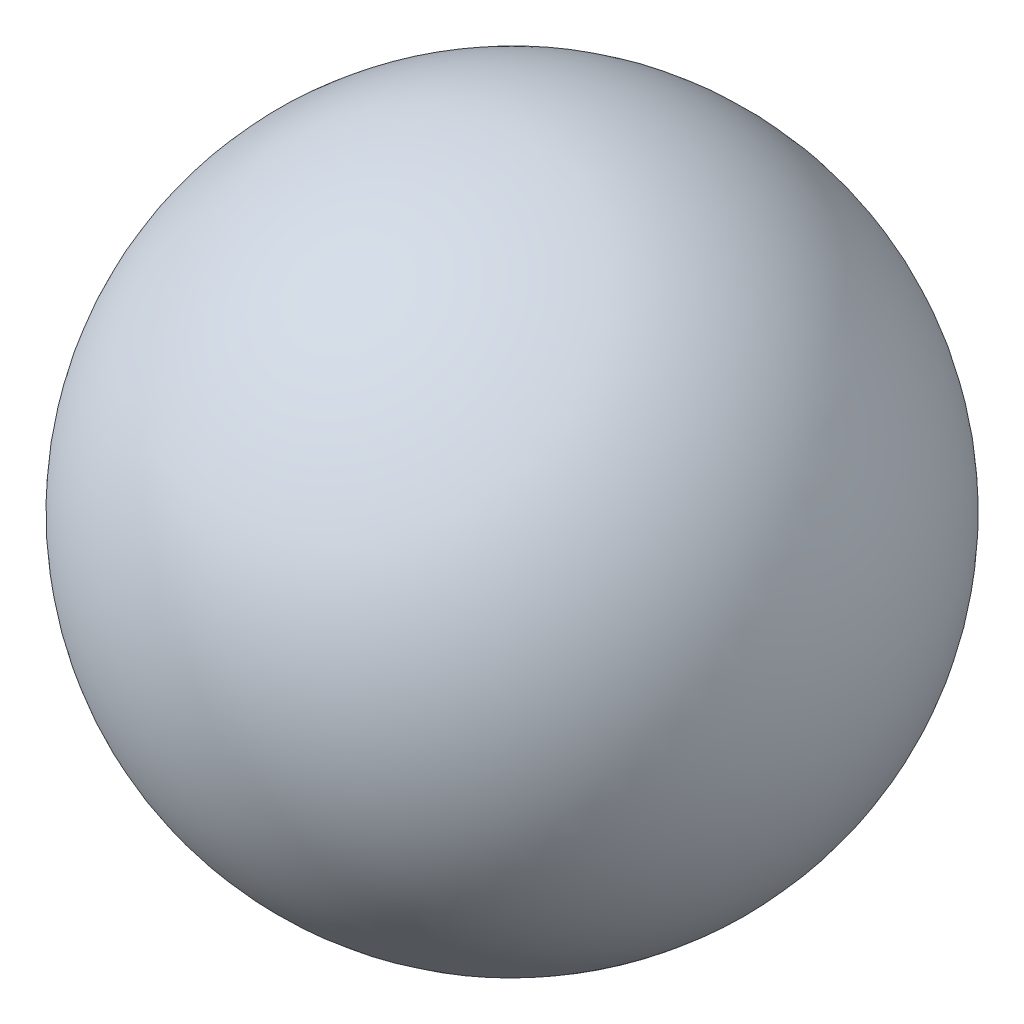
ISO-10303-21;
HEADER;
FILE_DESCRIPTION(('STEP AP214'),'2;1');
FILE_NAME('part.step','',(''),(''),'','','');
FILE_SCHEMA(('AUTOMOTIVE_DESIGN { 1 0 10303 214 1 1 1 1 }'));
ENDSEC;
DATA;
#1=APPLICATION_CONTEXT('core data for automotive mechanical design processes');
#2=APPLICATION_PROTOCOL_DEFINITION('international standard','automotive_design',2000,#1);
#3=PRODUCT_CONTEXT('',#1,'mechanical');
#4=PRODUCT('Part','Part','',(#3));
#5=PRODUCT_RELATED_PRODUCT_CATEGORY('part','',(#4));
#6=PRODUCT_DEFINITION_FORMATION('','',#4);
#7=PRODUCT_DEFINITION_CONTEXT('part definition',#1,'design');
#8=PRODUCT_DEFINITION('design','',#6,#7);
#9=PRODUCT_DEFINITION_SHAPE('','',#8);
#10=(LENGTH_UNIT() NAMED_UNIT(*) SI_UNIT(.MILLI.,.METRE.));
#11=(NAMED_UNIT(*) PLANE_ANGLE_UNIT() SI_UNIT($,.RADIAN.));
#12=(NAMED_UNIT(*) SI_UNIT($,.STERADIAN.) SOLID_ANGLE_UNIT());
#13=UNCERTAINTY_MEASURE_WITH_UNIT(LENGTH_MEASURE(1.E-05),#10,'distance_accuracy_value','');
#14=(GEOMETRIC_REPRESENTATION_CONTEXT(3) GLOBAL_UNCERTAINTY_ASSIGNED_CONTEXT((#13)) GLOBAL_UNIT_ASSIGNED_CONTEXT((#10,
#11,#12)) REPRESENTATION_CONTEXT('',''));
#15=CARTESIAN_POINT('',(0.,0.,0.));
#16=DIRECTION('',(0.,0.,1.));
#17=DIRECTION('',(1.,0.,0.));
#18=AXIS2_PLACEMENT_3D('',#15,#16,#17);
#19=CARTESIAN_POINT('',(67.76,-67.7713243227772,-14.7011345067971));
#20=DIRECTION('',(0.,-0.977271341040084,-0.211992278118133));
#21=DIRECTION('',(0.173648177666934,0.208771639069458,-0.962424393452912));
#22=AXIS2_PLACEMENT_3D('',#19,#20,#21);
#23=SPHERICAL_SURFACE('',#22,7.15);
#24=CARTESIAN_POINT('',(67.76,-60.7838342343406,-13.1853897182524));
#25=VERTEX_POINT('',#24);
#26=VERTEX_LOOP('',#25);
#27=FACE_BOUND('',#26,.T.);
#28=CARTESIAN_POINT('',(67.76,-74.7588144112138,-16.2168792953417));
#29=VERTEX_POINT('',#28);
#30=VERTEX_LOOP('',#29);
#31=FACE_BOUND('',#30,.T.);
#32=ADVANCED_FACE('F16',(#27,#31),#23,.T.);
#33=CLOSED_SHELL('',(#32));
#34=MANIFOLD_SOLID_BREP('B1',#33);
#35=ADVANCED_BREP_SHAPE_REPRESENTATION('',(#18,#34),#14);
#36=SHAPE_DEFINITION_REPRESENTATION(#9,#35);
ENDSEC;
END-ISO-10303-21;
